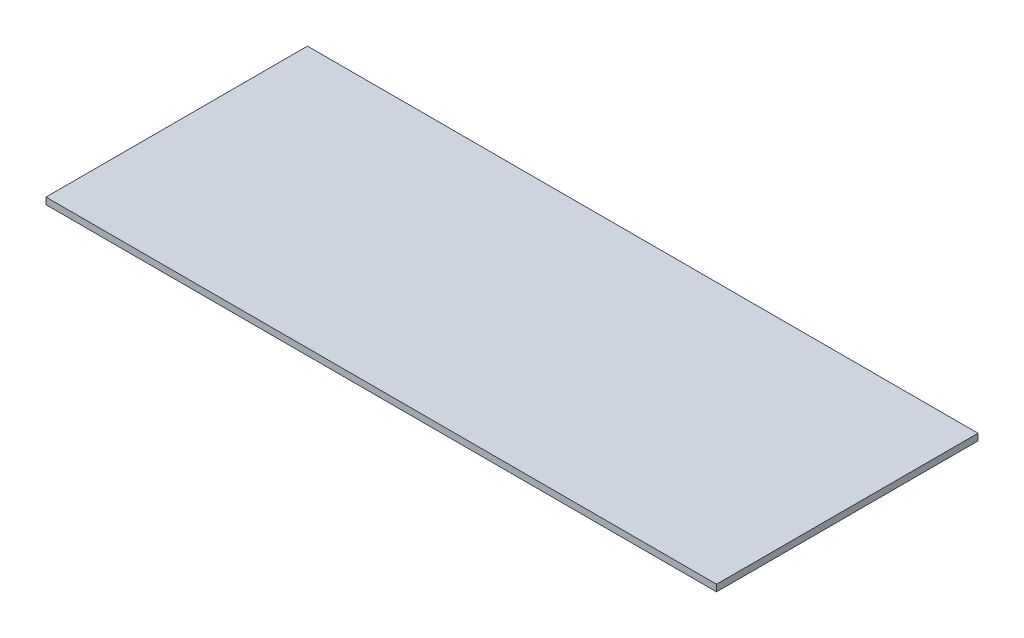
ISO-10303-21;
HEADER;
FILE_DESCRIPTION(('STEP AP214'),'2;1');
FILE_NAME('part.step','',(''),(''),'','','');
FILE_SCHEMA(('AUTOMOTIVE_DESIGN { 1 0 10303 214 1 1 1 1 }'));
ENDSEC;
DATA;
#1=APPLICATION_CONTEXT('core data for automotive mechanical design processes');
#2=APPLICATION_PROTOCOL_DEFINITION('international standard','automotive_design',2000,#1);
#3=PRODUCT_CONTEXT('',#1,'mechanical');
#4=PRODUCT('Part','Part','',(#3));
#5=PRODUCT_RELATED_PRODUCT_CATEGORY('part','',(#4));
#6=PRODUCT_DEFINITION_FORMATION('','',#4);
#7=PRODUCT_DEFINITION_CONTEXT('part definition',#1,'design');
#8=PRODUCT_DEFINITION('design','',#6,#7);
#9=PRODUCT_DEFINITION_SHAPE('','',#8);
#10=(LENGTH_UNIT() NAMED_UNIT(*) SI_UNIT(.MILLI.,.METRE.));
#11=(NAMED_UNIT(*) PLANE_ANGLE_UNIT() SI_UNIT($,.RADIAN.));
#12=(NAMED_UNIT(*) SI_UNIT($,.STERADIAN.) SOLID_ANGLE_UNIT());
#13=UNCERTAINTY_MEASURE_WITH_UNIT(LENGTH_MEASURE(1.E-05),#10,'distance_accuracy_value','');
#14=(GEOMETRIC_REPRESENTATION_CONTEXT(3) GLOBAL_UNCERTAINTY_ASSIGNED_CONTEXT((#13)) GLOBAL_UNIT_ASSIGNED_CONTEXT((#10,
#11,#12)) REPRESENTATION_CONTEXT('',''));
#15=CARTESIAN_POINT('',(0.,0.,0.));
#16=DIRECTION('',(0.,0.,1.));
#17=DIRECTION('',(1.,0.,0.));
#18=AXIS2_PLACEMENT_3D('',#15,#16,#17);
#19=CARTESIAN_POINT('',(1.44421856086621,4.0375,1.00071663533866));
#20=DIRECTION('',(0.,1.,0.));
#21=DIRECTION('',(0.,0.,1.));
#22=AXIS2_PLACEMENT_3D('',#19,#20,#21);
#23=PLANE('',#22);
#24=DIRECTION('',(1.,0.,0.));
#25=VECTOR('',#24,1.);
#26=CARTESIAN_POINT('',(123.642103305134,4.0375,-133.371553884729));
#27=LINE('',#26,#25);
#28=CARTESIAN_POINT('',(-286.692083130863,4.0375,-133.371553884729));
#29=VERTEX_POINT('',#28);
#30=CARTESIAN_POINT('',(123.642103305134,4.0375,-133.371553884729));
#31=VERTEX_POINT('',#30);
#32=EDGE_CURVE('E54',#29,#31,#27,.T.);
#33=ORIENTED_EDGE('',*,*,#32,.F.);
#34=DIRECTION('',(0.,0.,-1.));
#35=VECTOR('',#34,1.);
#36=CARTESIAN_POINT('',(-286.692083130863,4.0375,-133.371553884729));
#37=LINE('',#36,#35);
#38=CARTESIAN_POINT('',(-286.692083130863,4.0375,26.6284461152713));
#39=VERTEX_POINT('',#38);
#40=EDGE_CURVE('E113',#39,#29,#37,.T.);
#41=ORIENTED_EDGE('',*,*,#40,.F.);
#42=DIRECTION('',(-1.,0.,0.));
#43=VECTOR('',#42,1.);
#44=CARTESIAN_POINT('',(149.307916869137,4.0375,26.6284461152713));
#45=LINE('',#44,#43);
#46=CARTESIAN_POINT('',(123.642103305134,4.0375,26.6284461152713));
#47=VERTEX_POINT('',#46);
#48=EDGE_CURVE('E42',#47,#39,#45,.T.);
#49=ORIENTED_EDGE('',*,*,#48,.F.);
#50=DIRECTION('',(0.,0.,1.));
#51=VECTOR('',#50,1.);
#52=CARTESIAN_POINT('',(123.642103305134,4.0375,26.6284461152713));
#53=LINE('',#52,#51);
#54=EDGE_CURVE('E100',#31,#47,#53,.T.);
#55=ORIENTED_EDGE('',*,*,#54,.F.);
#56=EDGE_LOOP('',(#33,#41,#49,#55));
#57=FACE_BOUND('',#56,.T.);
#58=ADVANCED_FACE('F38',(#57),#23,.T.);
#59=CARTESIAN_POINT('',(1.44421856086621,-0.0374999999999999,1.00071663533866));
#60=DIRECTION('',(0.,1.,0.));
#61=DIRECTION('',(0.,0.,1.));
#62=AXIS2_PLACEMENT_3D('',#59,#60,#61);
#63=PLANE('',#62);
#64=DIRECTION('',(0.,0.,1.));
#65=VECTOR('',#64,1.);
#66=CARTESIAN_POINT('',(-286.692083130863,-0.0374999999999999,-133.371553884729));
#67=LINE('',#66,#65);
#68=CARTESIAN_POINT('',(-286.692083130863,-0.0375000000000005,-133.371553884729));
#69=VERTEX_POINT('',#68);
#70=CARTESIAN_POINT('',(-286.692083130863,-0.0374999999999999,26.6284461152713));
#71=VERTEX_POINT('',#70);
#72=EDGE_CURVE('E93',#69,#71,#67,.T.);
#73=ORIENTED_EDGE('',*,*,#72,.F.);
#74=DIRECTION('',(-1.,0.,0.));
#75=VECTOR('',#74,1.);
#76=CARTESIAN_POINT('',(123.642103305134,-0.0375000000000005,-133.371553884729));
#77=LINE('',#76,#75);
#78=CARTESIAN_POINT('',(123.642103305134,-0.0375000000000005,-133.371553884729));
#79=VERTEX_POINT('',#78);
#80=EDGE_CURVE('E81',#79,#69,#77,.T.);
#81=ORIENTED_EDGE('',*,*,#80,.F.);
#82=DIRECTION('',(0.,0.,-1.));
#83=VECTOR('',#82,1.);
#84=CARTESIAN_POINT('',(123.642103305134,-0.0375000000000005,26.6284461152713));
#85=LINE('',#84,#83);
#86=CARTESIAN_POINT('',(123.642103305134,-0.0375000000000005,26.6284461152713));
#87=VERTEX_POINT('',#86);
#88=EDGE_CURVE('E91',#87,#79,#85,.T.);
#89=ORIENTED_EDGE('',*,*,#88,.F.);
#90=DIRECTION('',(-1.,0.,0.));
#91=VECTOR('',#90,1.);
#92=CARTESIAN_POINT('',(149.307916869137,-0.0375000000000001,26.6284461152713));
#93=LINE('',#92,#91);
#94=EDGE_CURVE('E11',#87,#71,#93,.T.);
#95=ORIENTED_EDGE('',*,*,#94,.T.);
#96=EDGE_LOOP('',(#73,#81,#89,#95));
#97=FACE_BOUND('',#96,.T.);
#98=ADVANCED_FACE('F40',(#97),#63,.F.);
#99=CARTESIAN_POINT('',(149.307916869137,-0.0375000000000001,26.6284461152713));
#100=DIRECTION('',(0.,0.,-1.));
#101=DIRECTION('',(-1.,0.,0.));
#102=AXIS2_PLACEMENT_3D('',#99,#100,#101);
#103=PLANE('',#102);
#104=ORIENTED_EDGE('',*,*,#94,.F.);
#105=DIRECTION('',(0.,-1.,0.));
#106=VECTOR('',#105,1.);
#107=CARTESIAN_POINT('',(123.642103305134,-0.0375000000000005,26.6284461152713));
#108=LINE('',#107,#106);
#109=EDGE_CURVE('E98',#47,#87,#108,.T.);
#110=ORIENTED_EDGE('',*,*,#109,.F.);
#111=ORIENTED_EDGE('',*,*,#48,.T.);
#112=DIRECTION('',(0.,1.,0.));
#113=VECTOR('',#112,1.);
#114=CARTESIAN_POINT('',(-286.692083130863,-0.0374999999999999,26.6284461152713));
#115=LINE('',#114,#113);
#116=EDGE_CURVE('E110',#71,#39,#115,.T.);
#117=ORIENTED_EDGE('',*,*,#116,.F.);
#118=EDGE_LOOP('',(#104,#110,#111,#117));
#119=FACE_BOUND('',#118,.T.);
#120=ADVANCED_FACE('F124',(#119),#103,.F.);
#121=CARTESIAN_POINT('',(-286.692083130863,0.,0.));
#122=DIRECTION('',(1.,0.,0.));
#123=DIRECTION('',(0.,0.,-1.));
#124=AXIS2_PLACEMENT_3D('',#121,#122,#123);
#125=PLANE('',#124);
#126=ORIENTED_EDGE('',*,*,#40,.T.);
#127=DIRECTION('',(0.,1.,0.));
#128=VECTOR('',#127,1.);
#129=CARTESIAN_POINT('',(-286.692083130863,-0.0375000000000005,-133.371553884729));
#130=LINE('',#129,#128);
#131=EDGE_CURVE('E95',#69,#29,#130,.T.);
#132=ORIENTED_EDGE('',*,*,#131,.F.);
#133=ORIENTED_EDGE('',*,*,#72,.T.);
#134=ORIENTED_EDGE('',*,*,#116,.T.);
#135=EDGE_LOOP('',(#126,#132,#133,#134));
#136=FACE_BOUND('',#135,.T.);
#137=ADVANCED_FACE('F119',(#136),#125,.F.);
#138=CARTESIAN_POINT('',(123.642103305134,0.,0.));
#139=DIRECTION('',(-1.,0.,0.));
#140=DIRECTION('',(0.,0.,1.));
#141=AXIS2_PLACEMENT_3D('',#138,#139,#140);
#142=PLANE('',#141);
#143=ORIENTED_EDGE('',*,*,#88,.T.);
#144=DIRECTION('',(0.,-1.,0.));
#145=VECTOR('',#144,1.);
#146=CARTESIAN_POINT('',(123.642103305134,-0.0375000000000005,-133.371553884729));
#147=LINE('',#146,#145);
#148=EDGE_CURVE('E78',#31,#79,#147,.T.);
#149=ORIENTED_EDGE('',*,*,#148,.F.);
#150=ORIENTED_EDGE('',*,*,#54,.T.);
#151=ORIENTED_EDGE('',*,*,#109,.T.);
#152=EDGE_LOOP('',(#143,#149,#150,#151));
#153=FACE_BOUND('',#152,.T.);
#154=ADVANCED_FACE('F97',(#153),#142,.F.);
#155=CARTESIAN_POINT('',(0.,0.,-133.371553884729));
#156=DIRECTION('',(0.,0.,1.));
#157=DIRECTION('',(1.,0.,0.));
#158=AXIS2_PLACEMENT_3D('',#155,#156,#157);
#159=PLANE('',#158);
#160=ORIENTED_EDGE('',*,*,#148,.T.);
#161=ORIENTED_EDGE('',*,*,#80,.T.);
#162=ORIENTED_EDGE('',*,*,#131,.T.);
#163=ORIENTED_EDGE('',*,*,#32,.T.);
#164=EDGE_LOOP('',(#160,#161,#162,#163));
#165=FACE_BOUND('',#164,.T.);
#166=ADVANCED_FACE('F80',(#165),#159,.F.);
#167=CLOSED_SHELL('',(#58,#98,#120,#137,#154,#166));
#168=MANIFOLD_SOLID_BREP('B2',#167);
#169=ADVANCED_BREP_SHAPE_REPRESENTATION('',(#18,#168),#14);
#170=SHAPE_DEFINITION_REPRESENTATION(#9,#169);
ENDSEC;
END-ISO-10303-21;
